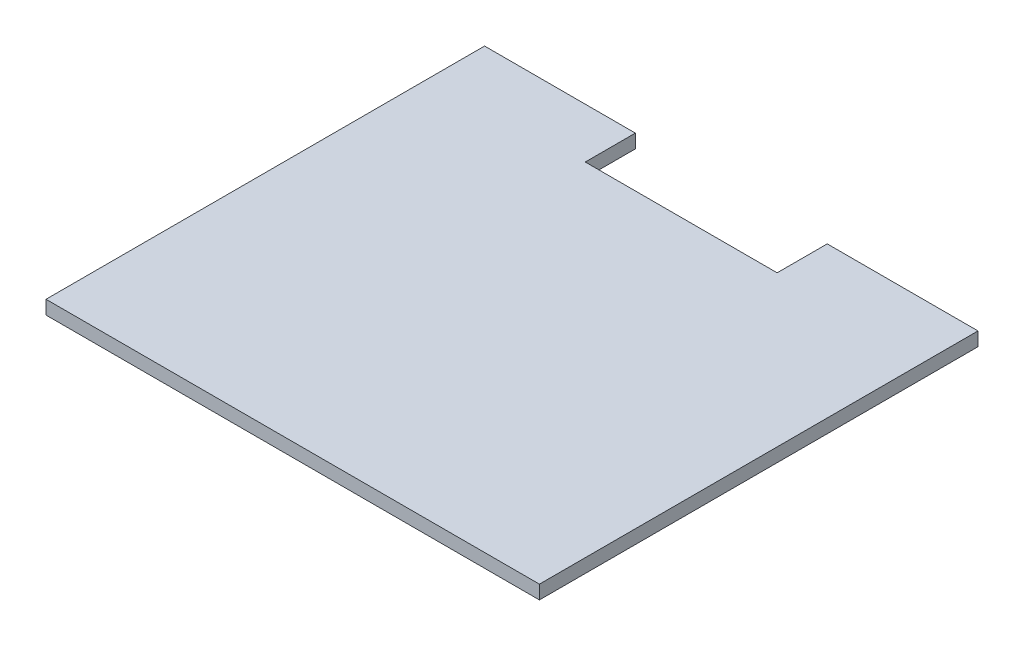
ISO-10303-21;
HEADER;
FILE_DESCRIPTION(('STEP AP214'),'2;1');
FILE_NAME('part.step','',(''),(''),'','','');
FILE_SCHEMA(('AUTOMOTIVE_DESIGN { 1 0 10303 214 1 1 1 1 }'));
ENDSEC;
DATA;
#1=APPLICATION_CONTEXT('core data for automotive mechanical design processes');
#2=APPLICATION_PROTOCOL_DEFINITION('international standard','automotive_design',2000,#1);
#3=PRODUCT_CONTEXT('',#1,'mechanical');
#4=PRODUCT('Part','Part','',(#3));
#5=PRODUCT_RELATED_PRODUCT_CATEGORY('part','',(#4));
#6=PRODUCT_DEFINITION_FORMATION('','',#4);
#7=PRODUCT_DEFINITION_CONTEXT('part definition',#1,'design');
#8=PRODUCT_DEFINITION('design','',#6,#7);
#9=PRODUCT_DEFINITION_SHAPE('','',#8);
#10=(LENGTH_UNIT() NAMED_UNIT(*) SI_UNIT(.MILLI.,.METRE.));
#11=(NAMED_UNIT(*) PLANE_ANGLE_UNIT() SI_UNIT($,.RADIAN.));
#12=(NAMED_UNIT(*) SI_UNIT($,.STERADIAN.) SOLID_ANGLE_UNIT());
#13=UNCERTAINTY_MEASURE_WITH_UNIT(LENGTH_MEASURE(1.E-05),#10,'distance_accuracy_value','');
#14=(GEOMETRIC_REPRESENTATION_CONTEXT(3) GLOBAL_UNCERTAINTY_ASSIGNED_CONTEXT((#13)) GLOBAL_UNIT_ASSIGNED_CONTEXT((#10,
#11,#12)) REPRESENTATION_CONTEXT('',''));
#15=CARTESIAN_POINT('',(0.,0.,0.));
#16=DIRECTION('',(0.,0.,1.));
#17=DIRECTION('',(1.,0.,0.));
#18=AXIS2_PLACEMENT_3D('',#15,#16,#17);
#19=CARTESIAN_POINT('',(-99.2461538461538,5.,-70.8307692307692));
#20=DIRECTION('',(0.,0.,1.));
#21=DIRECTION('',(1.,0.,0.));
#22=AXIS2_PLACEMENT_3D('',#19,#20,#21);
#23=PLANE('',#22);
#24=DIRECTION('',(-1.,0.,0.));
#25=VECTOR('',#24,1.);
#26=CARTESIAN_POINT('',(-99.2461538461538,0.,-70.8307692307692));
#27=LINE('',#26,#25);
#28=CARTESIAN_POINT('',(-99.2461538461538,0.,-70.8307692307692));
#29=VERTEX_POINT('',#28);
#30=CARTESIAN_POINT('',(-154.246153846154,0.,-70.8307692307692));
#31=VERTEX_POINT('',#30);
#32=EDGE_CURVE('E133',#29,#31,#27,.T.);
#33=ORIENTED_EDGE('',*,*,#32,.T.);
#34=DIRECTION('',(0.,-1.,0.));
#35=VECTOR('',#34,1.);
#36=CARTESIAN_POINT('',(-154.246153846154,5.,-70.8307692307692));
#37=LINE('',#36,#35);
#38=CARTESIAN_POINT('',(-154.246153846154,5.,-70.8307692307692));
#39=VERTEX_POINT('',#38);
#40=EDGE_CURVE('E11',#39,#31,#37,.T.);
#41=ORIENTED_EDGE('',*,*,#40,.F.);
#42=DIRECTION('',(-1.,0.,0.));
#43=VECTOR('',#42,1.);
#44=CARTESIAN_POINT('',(-99.2461538461538,5.,-70.8307692307692));
#45=LINE('',#44,#43);
#46=CARTESIAN_POINT('',(-99.2461538461538,5.,-70.8307692307692));
#47=VERTEX_POINT('',#46);
#48=EDGE_CURVE('E147',#47,#39,#45,.T.);
#49=ORIENTED_EDGE('',*,*,#48,.F.);
#50=DIRECTION('',(0.,-1.,0.));
#51=VECTOR('',#50,1.);
#52=CARTESIAN_POINT('',(-99.2461538461538,5.,-70.8307692307692));
#53=LINE('',#52,#51);
#54=EDGE_CURVE('E129',#47,#29,#53,.T.);
#55=ORIENTED_EDGE('',*,*,#54,.T.);
#56=EDGE_LOOP('',(#33,#41,#49,#55));
#57=FACE_BOUND('',#56,.T.);
#58=ADVANCED_FACE('F37',(#57),#23,.F.);
#59=CARTESIAN_POINT('',(-154.246153846154,5.,-70.8307692307692));
#60=DIRECTION('',(1.,0.,0.));
#61=DIRECTION('',(0.,0.,-1.));
#62=AXIS2_PLACEMENT_3D('',#59,#60,#61);
#63=PLANE('',#62);
#64=DIRECTION('',(0.,0.,1.));
#65=VECTOR('',#64,1.);
#66=CARTESIAN_POINT('',(-154.246153846154,0.,-70.8307692307692));
#67=LINE('',#66,#65);
#68=CARTESIAN_POINT('',(-154.246153846154,0.,89.1692307692308));
#69=VERTEX_POINT('',#68);
#70=EDGE_CURVE('E136',#31,#69,#67,.T.);
#71=ORIENTED_EDGE('',*,*,#70,.T.);
#72=DIRECTION('',(0.,-1.,0.));
#73=VECTOR('',#72,1.);
#74=CARTESIAN_POINT('',(-154.246153846154,5.,89.1692307692308));
#75=LINE('',#74,#73);
#76=CARTESIAN_POINT('',(-154.246153846154,5.,89.1692307692308));
#77=VERTEX_POINT('',#76);
#78=EDGE_CURVE('E45',#77,#69,#75,.T.);
#79=ORIENTED_EDGE('',*,*,#78,.F.);
#80=DIRECTION('',(0.,0.,1.));
#81=VECTOR('',#80,1.);
#82=CARTESIAN_POINT('',(-154.246153846154,5.,-70.8307692307692));
#83=LINE('',#82,#81);
#84=EDGE_CURVE('E96',#39,#77,#83,.T.);
#85=ORIENTED_EDGE('',*,*,#84,.F.);
#86=ORIENTED_EDGE('',*,*,#40,.T.);
#87=EDGE_LOOP('',(#71,#79,#85,#86));
#88=FACE_BOUND('',#87,.T.);
#89=ADVANCED_FACE('F182',(#88),#63,.F.);
#90=CARTESIAN_POINT('',(-154.246153846154,5.,89.1692307692308));
#91=DIRECTION('',(0.,0.,-1.));
#92=DIRECTION('',(-1.,0.,0.));
#93=AXIS2_PLACEMENT_3D('',#90,#91,#92);
#94=PLANE('',#93);
#95=DIRECTION('',(1.,0.,0.));
#96=VECTOR('',#95,1.);
#97=CARTESIAN_POINT('',(-154.246153846154,0.,89.1692307692308));
#98=LINE('',#97,#96);
#99=CARTESIAN_POINT('',(25.7538461538462,0.,89.1692307692308));
#100=VERTEX_POINT('',#99);
#101=EDGE_CURVE('E138',#69,#100,#98,.T.);
#102=ORIENTED_EDGE('',*,*,#101,.T.);
#103=DIRECTION('',(0.,-1.,0.));
#104=VECTOR('',#103,1.);
#105=CARTESIAN_POINT('',(25.7538461538462,5.,89.1692307692308));
#106=LINE('',#105,#104);
#107=CARTESIAN_POINT('',(25.7538461538462,5.,89.1692307692308));
#108=VERTEX_POINT('',#107);
#109=EDGE_CURVE('E154',#108,#100,#106,.T.);
#110=ORIENTED_EDGE('',*,*,#109,.F.);
#111=DIRECTION('',(1.,0.,0.));
#112=VECTOR('',#111,1.);
#113=CARTESIAN_POINT('',(-154.246153846154,5.,89.1692307692308));
#114=LINE('',#113,#112);
#115=EDGE_CURVE('E162',#77,#108,#114,.T.);
#116=ORIENTED_EDGE('',*,*,#115,.F.);
#117=ORIENTED_EDGE('',*,*,#78,.T.);
#118=EDGE_LOOP('',(#102,#110,#116,#117));
#119=FACE_BOUND('',#118,.T.);
#120=ADVANCED_FACE('F160',(#119),#94,.F.);
#121=CARTESIAN_POINT('',(25.7538461538462,5.,89.1692307692308));
#122=DIRECTION('',(-1.,0.,0.));
#123=DIRECTION('',(0.,0.,1.));
#124=AXIS2_PLACEMENT_3D('',#121,#122,#123);
#125=PLANE('',#124);
#126=DIRECTION('',(0.,0.,-1.));
#127=VECTOR('',#126,1.);
#128=CARTESIAN_POINT('',(25.7538461538462,0.,89.1692307692308));
#129=LINE('',#128,#127);
#130=CARTESIAN_POINT('',(25.7538461538462,0.,-70.8307692307692));
#131=VERTEX_POINT('',#130);
#132=EDGE_CURVE('E140',#100,#131,#129,.T.);
#133=ORIENTED_EDGE('',*,*,#132,.T.);
#134=DIRECTION('',(0.,-1.,0.));
#135=VECTOR('',#134,1.);
#136=CARTESIAN_POINT('',(25.7538461538462,5.,-70.8307692307692));
#137=LINE('',#136,#135);
#138=CARTESIAN_POINT('',(25.7538461538462,5.,-70.8307692307692));
#139=VERTEX_POINT('',#138);
#140=EDGE_CURVE('E151',#139,#131,#137,.T.);
#141=ORIENTED_EDGE('',*,*,#140,.F.);
#142=DIRECTION('',(0.,0.,-1.));
#143=VECTOR('',#142,1.);
#144=CARTESIAN_POINT('',(25.7538461538462,5.,89.1692307692308));
#145=LINE('',#144,#143);
#146=EDGE_CURVE('E174',#108,#139,#145,.T.);
#147=ORIENTED_EDGE('',*,*,#146,.F.);
#148=ORIENTED_EDGE('',*,*,#109,.T.);
#149=EDGE_LOOP('',(#133,#141,#147,#148));
#150=FACE_BOUND('',#149,.T.);
#151=ADVANCED_FACE('F170',(#150),#125,.F.);
#152=CARTESIAN_POINT('',(25.7538461538462,5.,-70.8307692307692));
#153=DIRECTION('',(0.,0.,1.));
#154=DIRECTION('',(1.,0.,0.));
#155=AXIS2_PLACEMENT_3D('',#152,#153,#154);
#156=PLANE('',#155);
#157=DIRECTION('',(-1.,0.,0.));
#158=VECTOR('',#157,1.);
#159=CARTESIAN_POINT('',(25.7538461538462,0.,-70.8307692307692));
#160=LINE('',#159,#158);
#161=CARTESIAN_POINT('',(-29.2461538461538,0.,-70.8307692307692));
#162=VERTEX_POINT('',#161);
#163=EDGE_CURVE('E142',#131,#162,#160,.T.);
#164=ORIENTED_EDGE('',*,*,#163,.T.);
#165=DIRECTION('',(0.,-1.,0.));
#166=VECTOR('',#165,1.);
#167=CARTESIAN_POINT('',(-29.2461538461538,5.,-70.8307692307692));
#168=LINE('',#167,#166);
#169=CARTESIAN_POINT('',(-29.2461538461538,5.,-70.8307692307692));
#170=VERTEX_POINT('',#169);
#171=EDGE_CURVE('E124',#170,#162,#168,.T.);
#172=ORIENTED_EDGE('',*,*,#171,.F.);
#173=DIRECTION('',(-1.,0.,0.));
#174=VECTOR('',#173,1.);
#175=CARTESIAN_POINT('',(25.7538461538462,5.,-70.8307692307692));
#176=LINE('',#175,#174);
#177=EDGE_CURVE('E115',#139,#170,#176,.T.);
#178=ORIENTED_EDGE('',*,*,#177,.F.);
#179=ORIENTED_EDGE('',*,*,#140,.T.);
#180=EDGE_LOOP('',(#164,#172,#178,#179));
#181=FACE_BOUND('',#180,.T.);
#182=ADVANCED_FACE('F173',(#181),#156,.F.);
#183=CARTESIAN_POINT('',(-29.2461538461538,5.,-70.8307692307692));
#184=DIRECTION('',(1.,0.,0.));
#185=DIRECTION('',(0.,0.,-1.));
#186=AXIS2_PLACEMENT_3D('',#183,#184,#185);
#187=PLANE('',#186);
#188=DIRECTION('',(0.,0.,1.));
#189=VECTOR('',#188,1.);
#190=CARTESIAN_POINT('',(-29.2461538461538,0.,-70.8307692307692));
#191=LINE('',#190,#189);
#192=CARTESIAN_POINT('',(-29.2461538461538,0.,-52.5538461538461));
#193=VERTEX_POINT('',#192);
#194=EDGE_CURVE('E123',#162,#193,#191,.T.);
#195=ORIENTED_EDGE('',*,*,#194,.T.);
#196=DIRECTION('',(0.,-1.,0.));
#197=VECTOR('',#196,1.);
#198=CARTESIAN_POINT('',(-29.2461538461538,5.,-52.5538461538461));
#199=LINE('',#198,#197);
#200=CARTESIAN_POINT('',(-29.2461538461538,5.,-52.5538461538461));
#201=VERTEX_POINT('',#200);
#202=EDGE_CURVE('E120',#201,#193,#199,.T.);
#203=ORIENTED_EDGE('',*,*,#202,.F.);
#204=DIRECTION('',(0.,0.,1.));
#205=VECTOR('',#204,1.);
#206=CARTESIAN_POINT('',(-29.2461538461538,5.,-70.8307692307692));
#207=LINE('',#206,#205);
#208=EDGE_CURVE('E109',#170,#201,#207,.T.);
#209=ORIENTED_EDGE('',*,*,#208,.F.);
#210=ORIENTED_EDGE('',*,*,#171,.T.);
#211=EDGE_LOOP('',(#195,#203,#209,#210));
#212=FACE_BOUND('',#211,.T.);
#213=ADVANCED_FACE('F121',(#212),#187,.F.);
#214=CARTESIAN_POINT('',(-29.2461538461538,5.,-52.5538461538461));
#215=DIRECTION('',(0.,0.,1.));
#216=DIRECTION('',(1.,0.,0.));
#217=AXIS2_PLACEMENT_3D('',#214,#215,#216);
#218=PLANE('',#217);
#219=DIRECTION('',(-1.,0.,0.));
#220=VECTOR('',#219,1.);
#221=CARTESIAN_POINT('',(-29.2461538461538,0.,-52.5538461538461));
#222=LINE('',#221,#220);
#223=CARTESIAN_POINT('',(-99.2461538461538,0.,-52.5538461538461));
#224=VERTEX_POINT('',#223);
#225=EDGE_CURVE('E82',#193,#224,#222,.T.);
#226=ORIENTED_EDGE('',*,*,#225,.T.);
#227=DIRECTION('',(0.,-1.,0.));
#228=VECTOR('',#227,1.);
#229=CARTESIAN_POINT('',(-99.2461538461538,5.,-52.5538461538461));
#230=LINE('',#229,#228);
#231=CARTESIAN_POINT('',(-99.2461538461538,5.,-52.5538461538461));
#232=VERTEX_POINT('',#231);
#233=EDGE_CURVE('E125',#232,#224,#230,.T.);
#234=ORIENTED_EDGE('',*,*,#233,.F.);
#235=DIRECTION('',(-1.,0.,0.));
#236=VECTOR('',#235,1.);
#237=CARTESIAN_POINT('',(-29.2461538461538,5.,-52.5538461538461));
#238=LINE('',#237,#236);
#239=EDGE_CURVE('E113',#201,#232,#238,.T.);
#240=ORIENTED_EDGE('',*,*,#239,.F.);
#241=ORIENTED_EDGE('',*,*,#202,.T.);
#242=EDGE_LOOP('',(#226,#234,#240,#241));
#243=FACE_BOUND('',#242,.T.);
#244=ADVANCED_FACE('F127',(#243),#218,.F.);
#245=CARTESIAN_POINT('',(-99.2461538461538,5.,-52.5538461538461));
#246=DIRECTION('',(-1.,0.,0.));
#247=DIRECTION('',(0.,0.,1.));
#248=AXIS2_PLACEMENT_3D('',#245,#246,#247);
#249=PLANE('',#248);
#250=DIRECTION('',(0.,0.,-1.));
#251=VECTOR('',#250,1.);
#252=CARTESIAN_POINT('',(-99.2461538461538,0.,-52.5538461538461));
#253=LINE('',#252,#251);
#254=EDGE_CURVE('E88',#224,#29,#253,.T.);
#255=ORIENTED_EDGE('',*,*,#254,.T.);
#256=ORIENTED_EDGE('',*,*,#54,.F.);
#257=DIRECTION('',(0.,0.,-1.));
#258=VECTOR('',#257,1.);
#259=CARTESIAN_POINT('',(-99.2461538461538,5.,-52.5538461538461));
#260=LINE('',#259,#258);
#261=EDGE_CURVE('E53',#232,#47,#260,.T.);
#262=ORIENTED_EDGE('',*,*,#261,.F.);
#263=ORIENTED_EDGE('',*,*,#233,.T.);
#264=EDGE_LOOP('',(#255,#256,#262,#263));
#265=FACE_BOUND('',#264,.T.);
#266=ADVANCED_FACE('F198',(#265),#249,.F.);
#267=CARTESIAN_POINT('',(0.,5.,0.));
#268=DIRECTION('',(0.,1.,0.));
#269=DIRECTION('',(0.,0.,1.));
#270=AXIS2_PLACEMENT_3D('',#267,#268,#269);
#271=PLANE('',#270);
#272=ORIENTED_EDGE('',*,*,#48,.T.);
#273=ORIENTED_EDGE('',*,*,#84,.T.);
#274=ORIENTED_EDGE('',*,*,#115,.T.);
#275=ORIENTED_EDGE('',*,*,#146,.T.);
#276=ORIENTED_EDGE('',*,*,#177,.T.);
#277=ORIENTED_EDGE('',*,*,#208,.T.);
#278=ORIENTED_EDGE('',*,*,#239,.T.);
#279=ORIENTED_EDGE('',*,*,#261,.T.);
#280=EDGE_LOOP('',(#272,#273,#274,#275,#276,#277,#278,#279));
#281=FACE_BOUND('',#280,.T.);
#282=ADVANCED_FACE('F111',(#281),#271,.T.);
#283=CARTESIAN_POINT('',(0.,0.,0.));
#284=DIRECTION('',(0.,1.,0.));
#285=DIRECTION('',(0.,0.,1.));
#286=AXIS2_PLACEMENT_3D('',#283,#284,#285);
#287=PLANE('',#286);
#288=ORIENTED_EDGE('',*,*,#32,.F.);
#289=ORIENTED_EDGE('',*,*,#254,.F.);
#290=ORIENTED_EDGE('',*,*,#225,.F.);
#291=ORIENTED_EDGE('',*,*,#194,.F.);
#292=ORIENTED_EDGE('',*,*,#163,.F.);
#293=ORIENTED_EDGE('',*,*,#132,.F.);
#294=ORIENTED_EDGE('',*,*,#101,.F.);
#295=ORIENTED_EDGE('',*,*,#70,.F.);
#296=EDGE_LOOP('',(#288,#289,#290,#291,#292,#293,#294,#295));
#297=FACE_BOUND('',#296,.T.);
#298=ADVANCED_FACE('F166',(#297),#287,.F.);
#299=CLOSED_SHELL('',(#58,#89,#120,#151,#182,#213,#244,#266,#282,#298));
#300=MANIFOLD_SOLID_BREP('B2',#299);
#301=ADVANCED_BREP_SHAPE_REPRESENTATION('',(#18,#300),#14);
#302=SHAPE_DEFINITION_REPRESENTATION(#9,#301);
ENDSEC;
END-ISO-10303-21;
